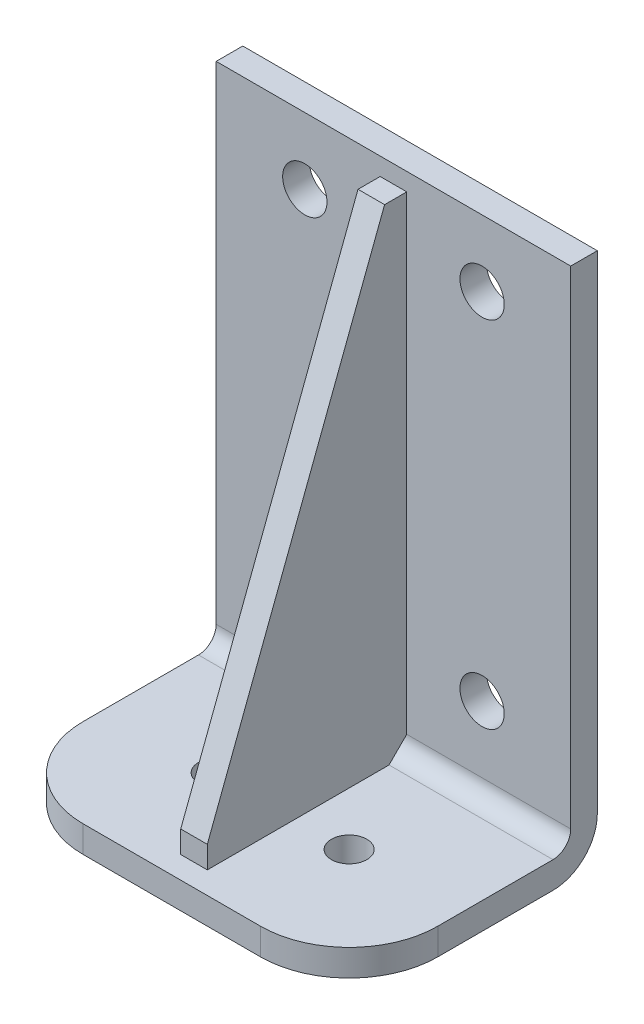
ISO-10303-21;
HEADER;
FILE_DESCRIPTION(('STEP AP214'),'2;1');
FILE_NAME('part.step','',(''),(''),'','','');
FILE_SCHEMA(('AUTOMOTIVE_DESIGN { 1 0 10303 214 1 1 1 1 }'));
ENDSEC;
DATA;
#1=APPLICATION_CONTEXT('core data for automotive mechanical design processes');
#2=APPLICATION_PROTOCOL_DEFINITION('international standard','automotive_design',2000,#1);
#3=PRODUCT_CONTEXT('',#1,'mechanical');
#4=PRODUCT('Part','Part','',(#3));
#5=PRODUCT_RELATED_PRODUCT_CATEGORY('part','',(#4));
#6=PRODUCT_DEFINITION_FORMATION('','',#4);
#7=PRODUCT_DEFINITION_CONTEXT('part definition',#1,'design');
#8=PRODUCT_DEFINITION('design','',#6,#7);
#9=PRODUCT_DEFINITION_SHAPE('','',#8);
#10=(LENGTH_UNIT() NAMED_UNIT(*) SI_UNIT(.MILLI.,.METRE.));
#11=(NAMED_UNIT(*) PLANE_ANGLE_UNIT() SI_UNIT($,.RADIAN.));
#12=(NAMED_UNIT(*) SI_UNIT($,.STERADIAN.) SOLID_ANGLE_UNIT());
#13=UNCERTAINTY_MEASURE_WITH_UNIT(LENGTH_MEASURE(1.E-05),#10,'distance_accuracy_value','');
#14=(GEOMETRIC_REPRESENTATION_CONTEXT(3) GLOBAL_UNCERTAINTY_ASSIGNED_CONTEXT((#13)) GLOBAL_UNIT_ASSIGNED_CONTEXT((#10,
#11,#12)) REPRESENTATION_CONTEXT('',''));
#15=CARTESIAN_POINT('',(0.,0.,0.));
#16=DIRECTION('',(0.,0.,1.));
#17=DIRECTION('',(1.,0.,0.));
#18=AXIS2_PLACEMENT_3D('',#15,#16,#17);
#19=CARTESIAN_POINT('',(0.,0.,6.));
#20=DIRECTION('',(0.,0.,-1.));
#21=DIRECTION('',(-1.,0.,0.));
#22=AXIS2_PLACEMENT_3D('',#19,#20,#21);
#23=PLANE('',#22);
#24=CARTESIAN_POINT('',(60.,25.,6.));
#25=DIRECTION('',(0.,0.,1.));
#26=DIRECTION('',(1.,0.,0.));
#27=AXIS2_PLACEMENT_3D('',#24,#25,#26);
#28=CIRCLE('',#27,5.);
#29=CARTESIAN_POINT('',(65.,25.,6.));
#30=VERTEX_POINT('',#29);
#31=EDGE_CURVE('E207',#30,#30,#28,.T.);
#32=ORIENTED_EDGE('',*,*,#31,.F.);
#33=EDGE_LOOP('',(#32));
#34=FACE_BOUND('',#33,.T.);
#35=CARTESIAN_POINT('',(20.,25.,6.));
#36=DIRECTION('',(0.,0.,1.));
#37=DIRECTION('',(1.,0.,0.));
#38=AXIS2_PLACEMENT_3D('',#35,#36,#37);
#39=CIRCLE('',#38,5.);
#40=CARTESIAN_POINT('',(25.,25.,6.));
#41=VERTEX_POINT('',#40);
#42=EDGE_CURVE('E201',#41,#41,#39,.T.);
#43=ORIENTED_EDGE('',*,*,#42,.F.);
#44=EDGE_LOOP('',(#43));
#45=FACE_BOUND('',#44,.T.);
#46=CARTESIAN_POINT('',(20.,105.,6.));
#47=DIRECTION('',(0.,0.,1.));
#48=DIRECTION('',(1.,0.,0.));
#49=AXIS2_PLACEMENT_3D('',#46,#47,#48);
#50=CIRCLE('',#49,5.);
#51=CARTESIAN_POINT('',(25.,105.,6.));
#52=VERTEX_POINT('',#51);
#53=EDGE_CURVE('E194',#52,#52,#50,.T.);
#54=ORIENTED_EDGE('',*,*,#53,.F.);
#55=EDGE_LOOP('',(#54));
#56=FACE_BOUND('',#55,.T.);
#57=CARTESIAN_POINT('',(60.,105.,6.));
#58=DIRECTION('',(0.,0.,1.));
#59=DIRECTION('',(1.,0.,0.));
#60=AXIS2_PLACEMENT_3D('',#57,#58,#59);
#61=CIRCLE('',#60,5.);
#62=CARTESIAN_POINT('',(65.,105.,6.));
#63=VERTEX_POINT('',#62);
#64=EDGE_CURVE('E212',#63,#63,#61,.T.);
#65=ORIENTED_EDGE('',*,*,#64,.F.);
#66=EDGE_LOOP('',(#65));
#67=FACE_BOUND('',#66,.T.);
#68=DIRECTION('',(-1.,0.,0.));
#69=VECTOR('',#68,1.);
#70=CARTESIAN_POINT('',(43.,116.,6.));
#71=LINE('',#70,#69);
#72=CARTESIAN_POINT('',(43.,116.,6.));
#73=VERTEX_POINT('',#72);
#74=CARTESIAN_POINT('',(37.,116.,6.));
#75=VERTEX_POINT('',#74);
#76=EDGE_CURVE('E165',#73,#75,#71,.T.);
#77=ORIENTED_EDGE('',*,*,#76,.F.);
#78=DIRECTION('',(0.,1.,0.));
#79=VECTOR('',#78,1.);
#80=CARTESIAN_POINT('',(43.,10.,6.));
#81=LINE('',#80,#79);
#82=CARTESIAN_POINT('',(43.,10.,6.));
#83=VERTEX_POINT('',#82);
#84=EDGE_CURVE('E162',#83,#73,#81,.T.);
#85=ORIENTED_EDGE('',*,*,#84,.F.);
#86=DIRECTION('',(-1.,0.,0.));
#87=VECTOR('',#86,1.);
#88=CARTESIAN_POINT('',(80.,10.,6.));
#89=LINE('',#88,#87);
#90=CARTESIAN_POINT('',(80.,10.,6.));
#91=VERTEX_POINT('',#90);
#92=EDGE_CURVE('E146',#83,#91,#89,.F.);
#93=ORIENTED_EDGE('',*,*,#92,.T.);
#94=DIRECTION('',(0.,1.,0.));
#95=VECTOR('',#94,1.);
#96=CARTESIAN_POINT('',(80.,0.,6.));
#97=LINE('',#96,#95);
#98=CARTESIAN_POINT('',(80.,120.,6.));
#99=VERTEX_POINT('',#98);
#100=EDGE_CURVE('E231',#91,#99,#97,.T.);
#101=ORIENTED_EDGE('',*,*,#100,.T.);
#102=DIRECTION('',(-1.,0.,0.));
#103=VECTOR('',#102,1.);
#104=CARTESIAN_POINT('',(0.,120.,6.));
#105=LINE('',#104,#103);
#106=CARTESIAN_POINT('',(0.,120.,6.));
#107=VERTEX_POINT('',#106);
#108=EDGE_CURVE('E234',#99,#107,#105,.T.);
#109=ORIENTED_EDGE('',*,*,#108,.T.);
#110=DIRECTION('',(0.,-1.,0.));
#111=VECTOR('',#110,1.);
#112=CARTESIAN_POINT('',(0.,0.,6.));
#113=LINE('',#112,#111);
#114=CARTESIAN_POINT('',(0.,10.,6.));
#115=VERTEX_POINT('',#114);
#116=EDGE_CURVE('E228',#107,#115,#113,.T.);
#117=ORIENTED_EDGE('',*,*,#116,.T.);
#118=CARTESIAN_POINT('',(37.,10.,6.));
#119=VERTEX_POINT('',#118);
#120=EDGE_CURVE('E158',#115,#119,#89,.F.);
#121=ORIENTED_EDGE('',*,*,#120,.T.);
#122=DIRECTION('',(0.,1.,0.));
#123=VECTOR('',#122,1.);
#124=CARTESIAN_POINT('',(37.,10.,6.));
#125=LINE('',#124,#123);
#126=EDGE_CURVE('E313',#119,#75,#125,.T.);
#127=ORIENTED_EDGE('',*,*,#126,.T.);
#128=EDGE_LOOP('',(#77,#85,#93,#101,#109,#117,#121,#127));
#129=FACE_BOUND('',#128,.T.);
#130=ADVANCED_FACE('F34',(#34,#45,#56,#67,#129),#23,.F.);
#131=CARTESIAN_POINT('',(0.,0.,6.));
#132=DIRECTION('',(1.,0.,0.));
#133=DIRECTION('',(0.,0.,-1.));
#134=AXIS2_PLACEMENT_3D('',#131,#132,#133);
#135=PLANE('',#134);
#136=DIRECTION('',(0.,0.,-1.));
#137=VECTOR('',#136,1.);
#138=CARTESIAN_POINT('',(0.,0.,6.));
#139=LINE('',#138,#137);
#140=CARTESIAN_POINT('',(0.,0.,36.));
#141=VERTEX_POINT('',#140);
#142=CARTESIAN_POINT('',(0.,0.,10.));
#143=VERTEX_POINT('',#142);
#144=EDGE_CURVE('E249',#141,#143,#139,.T.);
#145=ORIENTED_EDGE('',*,*,#144,.F.);
#146=DIRECTION('',(0.,-1.,0.));
#147=VECTOR('',#146,1.);
#148=CARTESIAN_POINT('',(0.,0.,36.));
#149=LINE('',#148,#147);
#150=CARTESIAN_POINT('',(0.,6.,36.));
#151=VERTEX_POINT('',#150);
#152=EDGE_CURVE('E57',#141,#151,#149,.F.);
#153=ORIENTED_EDGE('',*,*,#152,.T.);
#154=DIRECTION('',(0.,0.,-1.));
#155=VECTOR('',#154,1.);
#156=CARTESIAN_POINT('',(0.,6.,56.));
#157=LINE('',#156,#155);
#158=CARTESIAN_POINT('',(0.,6.,10.));
#159=VERTEX_POINT('',#158);
#160=EDGE_CURVE('E223',#151,#159,#157,.T.);
#161=ORIENTED_EDGE('',*,*,#160,.T.);
#162=CARTESIAN_POINT('',(0.,10.,10.));
#163=DIRECTION('',(1.,0.,0.));
#164=DIRECTION('',(0.,0.,-1.));
#165=AXIS2_PLACEMENT_3D('',#162,#163,#164);
#166=CIRCLE('',#165,4.);
#167=EDGE_CURVE('E254',#159,#115,#166,.T.);
#168=ORIENTED_EDGE('',*,*,#167,.T.);
#169=ORIENTED_EDGE('',*,*,#116,.F.);
#170=DIRECTION('',(0.,0.,-1.));
#171=VECTOR('',#170,1.);
#172=CARTESIAN_POINT('',(0.,120.,6.));
#173=LINE('',#172,#171);
#174=CARTESIAN_POINT('',(0.,120.,0.));
#175=VERTEX_POINT('',#174);
#176=EDGE_CURVE('E236',#107,#175,#173,.T.);
#177=ORIENTED_EDGE('',*,*,#176,.T.);
#178=DIRECTION('',(0.,-1.,0.));
#179=VECTOR('',#178,1.);
#180=CARTESIAN_POINT('',(0.,0.,0.));
#181=LINE('',#180,#179);
#182=CARTESIAN_POINT('',(0.,10.,0.));
#183=VERTEX_POINT('',#182);
#184=EDGE_CURVE('E227',#175,#183,#181,.T.);
#185=ORIENTED_EDGE('',*,*,#184,.T.);
#186=CARTESIAN_POINT('',(0.,10.,10.));
#187=DIRECTION('',(1.,0.,0.));
#188=DIRECTION('',(0.,0.,-1.));
#189=AXIS2_PLACEMENT_3D('',#186,#187,#188);
#190=CIRCLE('',#189,10.);
#191=EDGE_CURVE('E264',#183,#143,#190,.F.);
#192=ORIENTED_EDGE('',*,*,#191,.T.);
#193=EDGE_LOOP('',(#145,#153,#161,#168,#169,#177,#185,#192));
#194=FACE_BOUND('',#193,.T.);
#195=ADVANCED_FACE('F290',(#194),#135,.F.);
#196=CARTESIAN_POINT('',(0.,0.,6.));
#197=DIRECTION('',(0.,1.,0.));
#198=DIRECTION('',(0.,0.,1.));
#199=AXIS2_PLACEMENT_3D('',#196,#197,#198);
#200=PLANE('',#199);
#201=CARTESIAN_POINT('',(25.,0.,31.));
#202=DIRECTION('',(0.,1.,0.));
#203=DIRECTION('',(-1.,0.,0.));
#204=AXIS2_PLACEMENT_3D('',#201,#202,#203);
#205=CIRCLE('',#204,4.);
#206=CARTESIAN_POINT('',(21.,0.,31.));
#207=VERTEX_POINT('',#206);
#208=EDGE_CURVE('E338',#207,#207,#205,.T.);
#209=ORIENTED_EDGE('',*,*,#208,.T.);
#210=EDGE_LOOP('',(#209));
#211=FACE_BOUND('',#210,.T.);
#212=CARTESIAN_POINT('',(55.,0.,31.));
#213=DIRECTION('',(0.,1.,0.));
#214=DIRECTION('',(-1.,0.,0.));
#215=AXIS2_PLACEMENT_3D('',#212,#213,#214);
#216=CIRCLE('',#215,4.00000000000001);
#217=CARTESIAN_POINT('',(51.,0.,31.));
#218=VERTEX_POINT('',#217);
#219=EDGE_CURVE('E350',#218,#218,#216,.T.);
#220=ORIENTED_EDGE('',*,*,#219,.T.);
#221=EDGE_LOOP('',(#220));
#222=FACE_BOUND('',#221,.T.);
#223=DIRECTION('',(1.,0.,0.));
#224=VECTOR('',#223,1.);
#225=CARTESIAN_POINT('',(0.,0.,56.));
#226=LINE('',#225,#224);
#227=CARTESIAN_POINT('',(20.,0.,56.));
#228=VERTEX_POINT('',#227);
#229=CARTESIAN_POINT('',(60.,0.,56.));
#230=VERTEX_POINT('',#229);
#231=EDGE_CURVE('E215',#228,#230,#226,.T.);
#232=ORIENTED_EDGE('',*,*,#231,.F.);
#233=CARTESIAN_POINT('',(20.,0.,36.));
#234=DIRECTION('',(0.,1.,0.));
#235=DIRECTION('',(0.,0.,1.));
#236=AXIS2_PLACEMENT_3D('',#233,#234,#235);
#237=CIRCLE('',#236,20.);
#238=EDGE_CURVE('E275',#228,#141,#237,.F.);
#239=ORIENTED_EDGE('',*,*,#238,.T.);
#240=ORIENTED_EDGE('',*,*,#144,.T.);
#241=DIRECTION('',(1.,0.,0.));
#242=VECTOR('',#241,1.);
#243=CARTESIAN_POINT('',(80.,0.,10.));
#244=LINE('',#243,#242);
#245=CARTESIAN_POINT('',(80.,0.,10.));
#246=VERTEX_POINT('',#245);
#247=EDGE_CURVE('E257',#143,#246,#244,.T.);
#248=ORIENTED_EDGE('',*,*,#247,.T.);
#249=DIRECTION('',(0.,0.,-1.));
#250=VECTOR('',#249,1.);
#251=CARTESIAN_POINT('',(80.,0.,6.));
#252=LINE('',#251,#250);
#253=CARTESIAN_POINT('',(80.,0.,36.));
#254=VERTEX_POINT('',#253);
#255=EDGE_CURVE('E247',#254,#246,#252,.T.);
#256=ORIENTED_EDGE('',*,*,#255,.F.);
#257=CARTESIAN_POINT('',(60.,0.,36.));
#258=DIRECTION('',(0.,1.,0.));
#259=DIRECTION('',(0.,0.,1.));
#260=AXIS2_PLACEMENT_3D('',#257,#258,#259);
#261=CIRCLE('',#260,20.);
#262=EDGE_CURVE('E273',#254,#230,#261,.F.);
#263=ORIENTED_EDGE('',*,*,#262,.T.);
#264=EDGE_LOOP('',(#232,#239,#240,#248,#256,#263));
#265=FACE_BOUND('',#264,.T.);
#266=ADVANCED_FACE('F289',(#211,#222,#265),#200,.F.);
#267=CARTESIAN_POINT('',(80.,0.,6.));
#268=DIRECTION('',(-1.,0.,0.));
#269=DIRECTION('',(0.,0.,1.));
#270=AXIS2_PLACEMENT_3D('',#267,#268,#269);
#271=PLANE('',#270);
#272=DIRECTION('',(0.,0.,-1.));
#273=VECTOR('',#272,1.);
#274=CARTESIAN_POINT('',(80.,6.,56.));
#275=LINE('',#274,#273);
#276=CARTESIAN_POINT('',(80.,6.,36.));
#277=VERTEX_POINT('',#276);
#278=CARTESIAN_POINT('',(80.,6.,10.));
#279=VERTEX_POINT('',#278);
#280=EDGE_CURVE('E225',#277,#279,#275,.T.);
#281=ORIENTED_EDGE('',*,*,#280,.F.);
#282=DIRECTION('',(0.,1.,0.));
#283=VECTOR('',#282,1.);
#284=CARTESIAN_POINT('',(80.,0.,36.));
#285=LINE('',#284,#283);
#286=EDGE_CURVE('E11',#277,#254,#285,.F.);
#287=ORIENTED_EDGE('',*,*,#286,.T.);
#288=ORIENTED_EDGE('',*,*,#255,.T.);
#289=CARTESIAN_POINT('',(80.,10.,10.));
#290=DIRECTION('',(-1.,0.,0.));
#291=DIRECTION('',(0.,0.,1.));
#292=AXIS2_PLACEMENT_3D('',#289,#290,#291);
#293=CIRCLE('',#292,10.);
#294=CARTESIAN_POINT('',(80.,10.,0.));
#295=VERTEX_POINT('',#294);
#296=EDGE_CURVE('E260',#246,#295,#293,.F.);
#297=ORIENTED_EDGE('',*,*,#296,.T.);
#298=DIRECTION('',(0.,1.,0.));
#299=VECTOR('',#298,1.);
#300=CARTESIAN_POINT('',(80.,0.,0.));
#301=LINE('',#300,#299);
#302=CARTESIAN_POINT('',(80.,120.,0.));
#303=VERTEX_POINT('',#302);
#304=EDGE_CURVE('E239',#295,#303,#301,.T.);
#305=ORIENTED_EDGE('',*,*,#304,.T.);
#306=DIRECTION('',(0.,0.,-1.));
#307=VECTOR('',#306,1.);
#308=CARTESIAN_POINT('',(80.,120.,6.));
#309=LINE('',#308,#307);
#310=EDGE_CURVE('E244',#99,#303,#309,.T.);
#311=ORIENTED_EDGE('',*,*,#310,.F.);
#312=ORIENTED_EDGE('',*,*,#100,.F.);
#313=CARTESIAN_POINT('',(80.,10.,10.));
#314=DIRECTION('',(-1.,0.,0.));
#315=DIRECTION('',(0.,0.,1.));
#316=AXIS2_PLACEMENT_3D('',#313,#314,#315);
#317=CIRCLE('',#316,4.);
#318=EDGE_CURVE('E155',#91,#279,#317,.T.);
#319=ORIENTED_EDGE('',*,*,#318,.T.);
#320=EDGE_LOOP('',(#281,#287,#288,#297,#305,#311,#312,#319));
#321=FACE_BOUND('',#320,.T.);
#322=ADVANCED_FACE('F303',(#321),#271,.F.);
#323=CARTESIAN_POINT('',(0.,120.,6.));
#324=DIRECTION('',(0.,-1.,0.));
#325=DIRECTION('',(0.,0.,-1.));
#326=AXIS2_PLACEMENT_3D('',#323,#324,#325);
#327=PLANE('',#326);
#328=DIRECTION('',(-1.,0.,0.));
#329=VECTOR('',#328,1.);
#330=CARTESIAN_POINT('',(0.,120.,0.));
#331=LINE('',#330,#329);
#332=EDGE_CURVE('E232',#303,#175,#331,.T.);
#333=ORIENTED_EDGE('',*,*,#332,.T.);
#334=ORIENTED_EDGE('',*,*,#176,.F.);
#335=ORIENTED_EDGE('',*,*,#108,.F.);
#336=ORIENTED_EDGE('',*,*,#310,.T.);
#337=EDGE_LOOP('',(#333,#334,#335,#336));
#338=FACE_BOUND('',#337,.T.);
#339=ADVANCED_FACE('F390',(#338),#327,.F.);
#340=CARTESIAN_POINT('',(0.,0.,0.));
#341=DIRECTION('',(0.,0.,-1.));
#342=DIRECTION('',(-1.,0.,0.));
#343=AXIS2_PLACEMENT_3D('',#340,#341,#342);
#344=PLANE('',#343);
#345=CARTESIAN_POINT('',(60.,25.,0.));
#346=DIRECTION('',(0.,0.,-1.));
#347=DIRECTION('',(-1.,0.,0.));
#348=AXIS2_PLACEMENT_3D('',#345,#346,#347);
#349=CIRCLE('',#348,5.);
#350=CARTESIAN_POINT('',(55.,25.,0.));
#351=VERTEX_POINT('',#350);
#352=EDGE_CURVE('E193',#351,#351,#349,.F.);
#353=ORIENTED_EDGE('',*,*,#352,.T.);
#354=EDGE_LOOP('',(#353));
#355=FACE_BOUND('',#354,.T.);
#356=CARTESIAN_POINT('',(20.,25.,0.));
#357=DIRECTION('',(0.,0.,-1.));
#358=DIRECTION('',(-1.,0.,0.));
#359=AXIS2_PLACEMENT_3D('',#356,#357,#358);
#360=CIRCLE('',#359,5.);
#361=CARTESIAN_POINT('',(15.,25.,0.));
#362=VERTEX_POINT('',#361);
#363=EDGE_CURVE('E204',#362,#362,#360,.F.);
#364=ORIENTED_EDGE('',*,*,#363,.T.);
#365=EDGE_LOOP('',(#364));
#366=FACE_BOUND('',#365,.T.);
#367=CARTESIAN_POINT('',(20.,105.,0.));
#368=DIRECTION('',(0.,0.,-1.));
#369=DIRECTION('',(-1.,0.,0.));
#370=AXIS2_PLACEMENT_3D('',#367,#368,#369);
#371=CIRCLE('',#370,5.);
#372=CARTESIAN_POINT('',(15.,105.,0.));
#373=VERTEX_POINT('',#372);
#374=EDGE_CURVE('E198',#373,#373,#371,.F.);
#375=ORIENTED_EDGE('',*,*,#374,.T.);
#376=EDGE_LOOP('',(#375));
#377=FACE_BOUND('',#376,.T.);
#378=CARTESIAN_POINT('',(60.,105.,0.));
#379=DIRECTION('',(0.,0.,-1.));
#380=DIRECTION('',(-1.,0.,0.));
#381=AXIS2_PLACEMENT_3D('',#378,#379,#380);
#382=CIRCLE('',#381,5.);
#383=CARTESIAN_POINT('',(55.,105.,0.));
#384=VERTEX_POINT('',#383);
#385=EDGE_CURVE('E197',#384,#384,#382,.F.);
#386=ORIENTED_EDGE('',*,*,#385,.T.);
#387=EDGE_LOOP('',(#386));
#388=FACE_BOUND('',#387,.T.);
#389=ORIENTED_EDGE('',*,*,#304,.F.);
#390=DIRECTION('',(1.,0.,0.));
#391=VECTOR('',#390,1.);
#392=CARTESIAN_POINT('',(0.,10.,0.));
#393=LINE('',#392,#391);
#394=EDGE_CURVE('E262',#295,#183,#393,.F.);
#395=ORIENTED_EDGE('',*,*,#394,.T.);
#396=ORIENTED_EDGE('',*,*,#184,.F.);
#397=ORIENTED_EDGE('',*,*,#332,.F.);
#398=EDGE_LOOP('',(#389,#395,#396,#397));
#399=FACE_BOUND('',#398,.T.);
#400=ADVANCED_FACE('F360',(#355,#366,#377,#388,#399),#344,.T.);
#401=CARTESIAN_POINT('',(0.,6.,56.));
#402=DIRECTION('',(0.,-1.,0.));
#403=DIRECTION('',(1.,0.,0.));
#404=AXIS2_PLACEMENT_3D('',#401,#402,#403);
#405=PLANE('',#404);
#406=CARTESIAN_POINT('',(25.,6.,31.));
#407=DIRECTION('',(0.,1.,0.));
#408=DIRECTION('',(-1.,0.,0.));
#409=AXIS2_PLACEMENT_3D('',#406,#407,#408);
#410=CIRCLE('',#409,4.);
#411=CARTESIAN_POINT('',(21.,6.,31.));
#412=VERTEX_POINT('',#411);
#413=EDGE_CURVE('E340',#412,#412,#410,.T.);
#414=ORIENTED_EDGE('',*,*,#413,.F.);
#415=EDGE_LOOP('',(#414));
#416=FACE_BOUND('',#415,.T.);
#417=CARTESIAN_POINT('',(55.,6.,31.));
#418=DIRECTION('',(0.,1.,0.));
#419=DIRECTION('',(-1.,0.,0.));
#420=AXIS2_PLACEMENT_3D('',#417,#418,#419);
#421=CIRCLE('',#420,4.00000000000001);
#422=CARTESIAN_POINT('',(51.,6.,31.));
#423=VERTEX_POINT('',#422);
#424=EDGE_CURVE('E347',#423,#423,#421,.T.);
#425=ORIENTED_EDGE('',*,*,#424,.F.);
#426=EDGE_LOOP('',(#425));
#427=FACE_BOUND('',#426,.T.);
#428=ORIENTED_EDGE('',*,*,#160,.F.);
#429=CARTESIAN_POINT('',(20.,6.,36.));
#430=DIRECTION('',(0.,-1.,0.));
#431=DIRECTION('',(1.,0.,0.));
#432=AXIS2_PLACEMENT_3D('',#429,#430,#431);
#433=CIRCLE('',#432,20.);
#434=CARTESIAN_POINT('',(20.,6.,56.));
#435=VERTEX_POINT('',#434);
#436=EDGE_CURVE('E42',#151,#435,#433,.F.);
#437=ORIENTED_EDGE('',*,*,#436,.T.);
#438=DIRECTION('',(-1.,0.,0.));
#439=VECTOR('',#438,1.);
#440=CARTESIAN_POINT('',(0.,6.,56.));
#441=LINE('',#440,#439);
#442=CARTESIAN_POINT('',(60.,6.,56.));
#443=VERTEX_POINT('',#442);
#444=EDGE_CURVE('E220',#443,#435,#441,.T.);
#445=ORIENTED_EDGE('',*,*,#444,.F.);
#446=CARTESIAN_POINT('',(60.,6.,36.));
#447=DIRECTION('',(0.,-1.,0.));
#448=DIRECTION('',(1.,0.,0.));
#449=AXIS2_PLACEMENT_3D('',#446,#447,#448);
#450=CIRCLE('',#449,20.);
#451=EDGE_CURVE('E49',#443,#277,#450,.F.);
#452=ORIENTED_EDGE('',*,*,#451,.T.);
#453=ORIENTED_EDGE('',*,*,#280,.T.);
#454=DIRECTION('',(-1.,0.,0.));
#455=VECTOR('',#454,1.);
#456=CARTESIAN_POINT('',(0.,6.,10.));
#457=LINE('',#456,#455);
#458=CARTESIAN_POINT('',(43.,6.,10.));
#459=VERTEX_POINT('',#458);
#460=EDGE_CURVE('E159',#279,#459,#457,.T.);
#461=ORIENTED_EDGE('',*,*,#460,.T.);
#462=DIRECTION('',(0.,0.,-1.));
#463=VECTOR('',#462,1.);
#464=CARTESIAN_POINT('',(43.,6.,51.));
#465=LINE('',#464,#463);
#466=CARTESIAN_POINT('',(43.,6.,51.));
#467=VERTEX_POINT('',#466);
#468=EDGE_CURVE('E175',#467,#459,#465,.T.);
#469=ORIENTED_EDGE('',*,*,#468,.F.);
#470=DIRECTION('',(-1.,0.,0.));
#471=VECTOR('',#470,1.);
#472=CARTESIAN_POINT('',(43.,6.,51.));
#473=LINE('',#472,#471);
#474=CARTESIAN_POINT('',(37.,6.,51.));
#475=VERTEX_POINT('',#474);
#476=EDGE_CURVE('E186',#467,#475,#473,.T.);
#477=ORIENTED_EDGE('',*,*,#476,.T.);
#478=DIRECTION('',(0.,0.,-1.));
#479=VECTOR('',#478,1.);
#480=CARTESIAN_POINT('',(37.,6.,51.));
#481=LINE('',#480,#479);
#482=CARTESIAN_POINT('',(37.,6.,10.));
#483=VERTEX_POINT('',#482);
#484=EDGE_CURVE('E310',#475,#483,#481,.T.);
#485=ORIENTED_EDGE('',*,*,#484,.T.);
#486=EDGE_CURVE('E251',#483,#159,#457,.T.);
#487=ORIENTED_EDGE('',*,*,#486,.T.);
#488=EDGE_LOOP('',(#428,#437,#445,#452,#453,#461,#469,#477,#485,#487));
#489=FACE_BOUND('',#488,.T.);
#490=ADVANCED_FACE('F279',(#416,#427,#489),#405,.F.);
#491=CARTESIAN_POINT('',(0.,0.,56.));
#492=DIRECTION('',(0.,0.,-1.));
#493=DIRECTION('',(-1.,0.,0.));
#494=AXIS2_PLACEMENT_3D('',#491,#492,#493);
#495=PLANE('',#494);
#496=ORIENTED_EDGE('',*,*,#444,.T.);
#497=DIRECTION('',(0.,-1.,0.));
#498=VECTOR('',#497,1.);
#499=CARTESIAN_POINT('',(20.,0.,56.));
#500=LINE('',#499,#498);
#501=EDGE_CURVE('E270',#435,#228,#500,.T.);
#502=ORIENTED_EDGE('',*,*,#501,.T.);
#503=ORIENTED_EDGE('',*,*,#231,.T.);
#504=DIRECTION('',(0.,1.,0.));
#505=VECTOR('',#504,1.);
#506=CARTESIAN_POINT('',(60.,0.,56.));
#507=LINE('',#506,#505);
#508=EDGE_CURVE('E267',#230,#443,#507,.T.);
#509=ORIENTED_EDGE('',*,*,#508,.T.);
#510=EDGE_LOOP('',(#496,#502,#503,#509));
#511=FACE_BOUND('',#510,.T.);
#512=ADVANCED_FACE('F284',(#511),#495,.F.);
#513=CARTESIAN_POINT('',(0.,10.,10.));
#514=DIRECTION('',(1.,0.,0.));
#515=DIRECTION('',(0.,1.,0.));
#516=AXIS2_PLACEMENT_3D('',#513,#514,#515);
#517=CYLINDRICAL_SURFACE('',#516,4.);
#518=ORIENTED_EDGE('',*,*,#318,.F.);
#519=ORIENTED_EDGE('',*,*,#92,.F.);
#520=DIRECTION('',(-1.,0.,0.));
#521=VECTOR('',#520,1.);
#522=CARTESIAN_POINT('',(43.,10.,6.));
#523=LINE('',#522,#521);
#524=EDGE_CURVE('E151',#83,#119,#523,.T.);
#525=ORIENTED_EDGE('',*,*,#524,.T.);
#526=ORIENTED_EDGE('',*,*,#120,.F.);
#527=ORIENTED_EDGE('',*,*,#167,.F.);
#528=ORIENTED_EDGE('',*,*,#486,.F.);
#529=DIRECTION('',(-1.,0.,0.));
#530=VECTOR('',#529,1.);
#531=CARTESIAN_POINT('',(43.,6.,10.));
#532=LINE('',#531,#530);
#533=EDGE_CURVE('E184',#459,#483,#532,.T.);
#534=ORIENTED_EDGE('',*,*,#533,.F.);
#535=ORIENTED_EDGE('',*,*,#460,.F.);
#536=EDGE_LOOP('',(#518,#519,#525,#526,#527,#528,#534,#535));
#537=FACE_BOUND('',#536,.T.);
#538=ADVANCED_FACE('F148',(#537),#517,.F.);
#539=CARTESIAN_POINT('',(0.,10.,10.));
#540=DIRECTION('',(-1.,0.,0.));
#541=DIRECTION('',(0.,0.,1.));
#542=AXIS2_PLACEMENT_3D('',#539,#540,#541);
#543=CYLINDRICAL_SURFACE('',#542,10.);
#544=ORIENTED_EDGE('',*,*,#191,.F.);
#545=ORIENTED_EDGE('',*,*,#394,.F.);
#546=ORIENTED_EDGE('',*,*,#296,.F.);
#547=ORIENTED_EDGE('',*,*,#247,.F.);
#548=EDGE_LOOP('',(#544,#545,#546,#547));
#549=FACE_BOUND('',#548,.T.);
#550=ADVANCED_FACE('F297',(#549),#543,.T.);
#551=CARTESIAN_POINT('',(60.,105.,-0.00100000000000013));
#552=DIRECTION('',(0.,0.,1.));
#553=DIRECTION('',(1.,0.,0.));
#554=AXIS2_PLACEMENT_3D('',#551,#552,#553);
#555=CYLINDRICAL_SURFACE('',#554,5.);
#556=ORIENTED_EDGE('',*,*,#385,.F.);
#557=EDGE_LOOP('',(#556));
#558=FACE_BOUND('',#557,.T.);
#559=ORIENTED_EDGE('',*,*,#64,.T.);
#560=EDGE_LOOP('',(#559));
#561=FACE_BOUND('',#560,.T.);
#562=ADVANCED_FACE('F403',(#558,#561),#555,.F.);
#563=CARTESIAN_POINT('',(20.,105.,-0.00100000000000013));
#564=DIRECTION('',(0.,0.,1.));
#565=DIRECTION('',(1.,0.,0.));
#566=AXIS2_PLACEMENT_3D('',#563,#564,#565);
#567=CYLINDRICAL_SURFACE('',#566,5.);
#568=ORIENTED_EDGE('',*,*,#374,.F.);
#569=EDGE_LOOP('',(#568));
#570=FACE_BOUND('',#569,.T.);
#571=ORIENTED_EDGE('',*,*,#53,.T.);
#572=EDGE_LOOP('',(#571));
#573=FACE_BOUND('',#572,.T.);
#574=ADVANCED_FACE('F537',(#570,#573),#567,.F.);
#575=CARTESIAN_POINT('',(20.,25.,-0.00100000000000013));
#576=DIRECTION('',(0.,0.,1.));
#577=DIRECTION('',(1.,0.,0.));
#578=AXIS2_PLACEMENT_3D('',#575,#576,#577);
#579=CYLINDRICAL_SURFACE('',#578,5.);
#580=ORIENTED_EDGE('',*,*,#363,.F.);
#581=EDGE_LOOP('',(#580));
#582=FACE_BOUND('',#581,.T.);
#583=ORIENTED_EDGE('',*,*,#42,.T.);
#584=EDGE_LOOP('',(#583));
#585=FACE_BOUND('',#584,.T.);
#586=ADVANCED_FACE('F527',(#582,#585),#579,.F.);
#587=CARTESIAN_POINT('',(60.,25.,-0.00100000000000013));
#588=DIRECTION('',(0.,0.,1.));
#589=DIRECTION('',(1.,0.,0.));
#590=AXIS2_PLACEMENT_3D('',#587,#588,#589);
#591=CYLINDRICAL_SURFACE('',#590,5.);
#592=ORIENTED_EDGE('',*,*,#352,.F.);
#593=EDGE_LOOP('',(#592));
#594=FACE_BOUND('',#593,.T.);
#595=ORIENTED_EDGE('',*,*,#31,.T.);
#596=EDGE_LOOP('',(#595));
#597=FACE_BOUND('',#596,.T.);
#598=ADVANCED_FACE('F508',(#594,#597),#591,.F.);
#599=CARTESIAN_POINT('',(43.,11.,51.));
#600=DIRECTION('',(0.,0.,-1.));
#601=DIRECTION('',(-1.,0.,0.));
#602=AXIS2_PLACEMENT_3D('',#599,#600,#601);
#603=PLANE('',#602);
#604=DIRECTION('',(0.,-1.,0.));
#605=VECTOR('',#604,1.);
#606=CARTESIAN_POINT('',(37.,11.,51.));
#607=LINE('',#606,#605);
#608=CARTESIAN_POINT('',(37.,11.,51.));
#609=VERTEX_POINT('',#608);
#610=EDGE_CURVE('E317',#609,#475,#607,.T.);
#611=ORIENTED_EDGE('',*,*,#610,.T.);
#612=ORIENTED_EDGE('',*,*,#476,.F.);
#613=DIRECTION('',(0.,-1.,0.));
#614=VECTOR('',#613,1.);
#615=CARTESIAN_POINT('',(43.,11.,51.));
#616=LINE('',#615,#614);
#617=CARTESIAN_POINT('',(43.,11.,51.));
#618=VERTEX_POINT('',#617);
#619=EDGE_CURVE('E324',#618,#467,#616,.T.);
#620=ORIENTED_EDGE('',*,*,#619,.F.);
#621=DIRECTION('',(-1.,0.,0.));
#622=VECTOR('',#621,1.);
#623=CARTESIAN_POINT('',(43.,11.,51.));
#624=LINE('',#623,#622);
#625=EDGE_CURVE('E325',#618,#609,#624,.T.);
#626=ORIENTED_EDGE('',*,*,#625,.T.);
#627=EDGE_LOOP('',(#611,#612,#620,#626));
#628=FACE_BOUND('',#627,.T.);
#629=ADVANCED_FACE('F499',(#628),#603,.F.);
#630=CARTESIAN_POINT('',(43.,6.,10.));
#631=DIRECTION('',(0.,0.707106781186548,0.707106781186547));
#632=DIRECTION('',(0.,-0.707106781186547,0.707106781186548));
#633=AXIS2_PLACEMENT_3D('',#630,#631,#632);
#634=PLANE('',#633);
#635=DIRECTION('',(0.,0.707106781186547,-0.707106781186548));
#636=VECTOR('',#635,1.);
#637=CARTESIAN_POINT('',(37.,6.,10.));
#638=LINE('',#637,#636);
#639=EDGE_CURVE('E182',#483,#119,#638,.T.);
#640=ORIENTED_EDGE('',*,*,#639,.T.);
#641=ORIENTED_EDGE('',*,*,#524,.F.);
#642=DIRECTION('',(0.,0.707106781186547,-0.707106781186548));
#643=VECTOR('',#642,1.);
#644=CARTESIAN_POINT('',(43.,6.,10.));
#645=LINE('',#644,#643);
#646=EDGE_CURVE('E169',#459,#83,#645,.T.);
#647=ORIENTED_EDGE('',*,*,#646,.F.);
#648=ORIENTED_EDGE('',*,*,#533,.T.);
#649=EDGE_LOOP('',(#640,#641,#647,#648));
#650=FACE_BOUND('',#649,.T.);
#651=ADVANCED_FACE('F180',(#650),#634,.F.);
#652=CARTESIAN_POINT('',(43.,116.,6.));
#653=DIRECTION('',(0.,-1.,0.));
#654=DIRECTION('',(0.,0.,-1.));
#655=AXIS2_PLACEMENT_3D('',#652,#653,#654);
#656=PLANE('',#655);
#657=DIRECTION('',(0.,0.,1.));
#658=VECTOR('',#657,1.);
#659=CARTESIAN_POINT('',(37.,116.,6.));
#660=LINE('',#659,#658);
#661=CARTESIAN_POINT('',(37.,116.,11.));
#662=VERTEX_POINT('',#661);
#663=EDGE_CURVE('E315',#75,#662,#660,.T.);
#664=ORIENTED_EDGE('',*,*,#663,.T.);
#665=DIRECTION('',(-1.,0.,0.));
#666=VECTOR('',#665,1.);
#667=CARTESIAN_POINT('',(43.,116.,11.));
#668=LINE('',#667,#666);
#669=CARTESIAN_POINT('',(43.,116.,11.));
#670=VERTEX_POINT('',#669);
#671=EDGE_CURVE('E188',#670,#662,#668,.T.);
#672=ORIENTED_EDGE('',*,*,#671,.F.);
#673=DIRECTION('',(0.,0.,1.));
#674=VECTOR('',#673,1.);
#675=CARTESIAN_POINT('',(43.,116.,6.));
#676=LINE('',#675,#674);
#677=EDGE_CURVE('E168',#73,#670,#676,.T.);
#678=ORIENTED_EDGE('',*,*,#677,.F.);
#679=ORIENTED_EDGE('',*,*,#76,.T.);
#680=EDGE_LOOP('',(#664,#672,#678,#679));
#681=FACE_BOUND('',#680,.T.);
#682=ADVANCED_FACE('F482',(#681),#656,.F.);
#683=CARTESIAN_POINT('',(43.,116.,11.));
#684=DIRECTION('',(0.,-0.355995327591988,-0.934487734928968));
#685=DIRECTION('',(0.,0.934487734928968,-0.355995327591988));
#686=AXIS2_PLACEMENT_3D('',#683,#684,#685);
#687=PLANE('',#686);
#688=DIRECTION('',(0.,-0.934487734928968,0.355995327591988));
#689=VECTOR('',#688,1.);
#690=CARTESIAN_POINT('',(37.,116.,11.));
#691=LINE('',#690,#689);
#692=EDGE_CURVE('E322',#662,#609,#691,.T.);
#693=ORIENTED_EDGE('',*,*,#692,.T.);
#694=ORIENTED_EDGE('',*,*,#625,.F.);
#695=DIRECTION('',(0.,-0.934487734928968,0.355995327591988));
#696=VECTOR('',#695,1.);
#697=CARTESIAN_POINT('',(43.,116.,11.));
#698=LINE('',#697,#696);
#699=EDGE_CURVE('E327',#670,#618,#698,.T.);
#700=ORIENTED_EDGE('',*,*,#699,.F.);
#701=ORIENTED_EDGE('',*,*,#671,.T.);
#702=EDGE_LOOP('',(#693,#694,#700,#701));
#703=FACE_BOUND('',#702,.T.);
#704=ADVANCED_FACE('F333',(#703),#687,.F.);
#705=CARTESIAN_POINT('',(43.,0.,0.));
#706=DIRECTION('',(1.,0.,0.));
#707=DIRECTION('',(0.,0.,-1.));
#708=AXIS2_PLACEMENT_3D('',#705,#706,#707);
#709=PLANE('',#708);
#710=ORIENTED_EDGE('',*,*,#619,.T.);
#711=ORIENTED_EDGE('',*,*,#468,.T.);
#712=ORIENTED_EDGE('',*,*,#646,.T.);
#713=ORIENTED_EDGE('',*,*,#84,.T.);
#714=ORIENTED_EDGE('',*,*,#677,.T.);
#715=ORIENTED_EDGE('',*,*,#699,.T.);
#716=EDGE_LOOP('',(#710,#711,#712,#713,#714,#715));
#717=FACE_BOUND('',#716,.T.);
#718=ADVANCED_FACE('F174',(#717),#709,.T.);
#719=CARTESIAN_POINT('',(37.,0.,0.));
#720=DIRECTION('',(1.,0.,0.));
#721=DIRECTION('',(0.,0.,-1.));
#722=AXIS2_PLACEMENT_3D('',#719,#720,#721);
#723=PLANE('',#722);
#724=ORIENTED_EDGE('',*,*,#610,.F.);
#725=ORIENTED_EDGE('',*,*,#692,.F.);
#726=ORIENTED_EDGE('',*,*,#663,.F.);
#727=ORIENTED_EDGE('',*,*,#126,.F.);
#728=ORIENTED_EDGE('',*,*,#639,.F.);
#729=ORIENTED_EDGE('',*,*,#484,.F.);
#730=EDGE_LOOP('',(#724,#725,#726,#727,#728,#729));
#731=FACE_BOUND('',#730,.T.);
#732=ADVANCED_FACE('F309',(#731),#723,.F.);
#733=CARTESIAN_POINT('',(55.,0.,31.));
#734=DIRECTION('',(0.,1.,0.));
#735=DIRECTION('',(-1.,0.,0.));
#736=AXIS2_PLACEMENT_3D('',#733,#734,#735);
#737=CYLINDRICAL_SURFACE('',#736,4.00000000000001);
#738=ORIENTED_EDGE('',*,*,#219,.F.);
#739=EDGE_LOOP('',(#738));
#740=FACE_BOUND('',#739,.T.);
#741=ORIENTED_EDGE('',*,*,#424,.T.);
#742=EDGE_LOOP('',(#741));
#743=FACE_BOUND('',#742,.T.);
#744=ADVANCED_FACE('F364',(#740,#743),#737,.F.);
#745=CARTESIAN_POINT('',(25.,0.,31.));
#746=DIRECTION('',(0.,1.,0.));
#747=DIRECTION('',(-1.,0.,0.));
#748=AXIS2_PLACEMENT_3D('',#745,#746,#747);
#749=CYLINDRICAL_SURFACE('',#748,4.);
#750=ORIENTED_EDGE('',*,*,#208,.F.);
#751=EDGE_LOOP('',(#750));
#752=FACE_BOUND('',#751,.T.);
#753=ORIENTED_EDGE('',*,*,#413,.T.);
#754=EDGE_LOOP('',(#753));
#755=FACE_BOUND('',#754,.T.);
#756=ADVANCED_FACE('F356',(#752,#755),#749,.F.);
#757=CARTESIAN_POINT('',(20.,0.,36.));
#758=DIRECTION('',(0.,-1.,0.));
#759=DIRECTION('',(0.,0.,-1.));
#760=AXIS2_PLACEMENT_3D('',#757,#758,#759);
#761=CYLINDRICAL_SURFACE('',#760,20.);
#762=ORIENTED_EDGE('',*,*,#436,.F.);
#763=ORIENTED_EDGE('',*,*,#152,.F.);
#764=ORIENTED_EDGE('',*,*,#238,.F.);
#765=ORIENTED_EDGE('',*,*,#501,.F.);
#766=EDGE_LOOP('',(#762,#763,#764,#765));
#767=FACE_BOUND('',#766,.T.);
#768=ADVANCED_FACE('F287',(#767),#761,.T.);
#769=CARTESIAN_POINT('',(60.,0.,36.));
#770=DIRECTION('',(0.,1.,0.));
#771=DIRECTION('',(0.,0.,1.));
#772=AXIS2_PLACEMENT_3D('',#769,#770,#771);
#773=CYLINDRICAL_SURFACE('',#772,20.);
#774=ORIENTED_EDGE('',*,*,#262,.F.);
#775=ORIENTED_EDGE('',*,*,#286,.F.);
#776=ORIENTED_EDGE('',*,*,#451,.F.);
#777=ORIENTED_EDGE('',*,*,#508,.F.);
#778=EDGE_LOOP('',(#774,#775,#776,#777));
#779=FACE_BOUND('',#778,.T.);
#780=ADVANCED_FACE('F36',(#779),#773,.T.);
#781=CLOSED_SHELL('',(#130,#195,#266,#322,#339,#400,#490,#512,#538,#550,#562,#574,#586,#598,
#629,#651,#682,#704,#718,#732,#744,#756,#768,#780));
#782=MANIFOLD_SOLID_BREP('B2',#781);
#783=ADVANCED_BREP_SHAPE_REPRESENTATION('',(#18,#782),#14);
#784=SHAPE_DEFINITION_REPRESENTATION(#9,#783);
ENDSEC;
END-ISO-10303-21;
